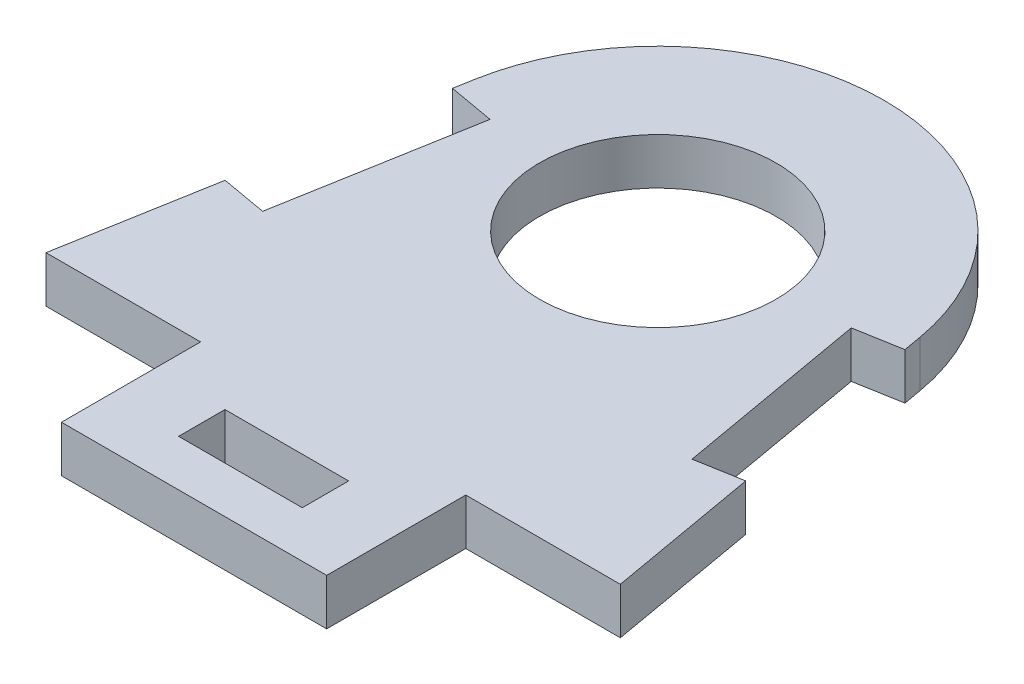
ISO-10303-21;
HEADER;
FILE_DESCRIPTION(('STEP AP214'),'2;1');
FILE_NAME('part.step','',(''),(''),'','','');
FILE_SCHEMA(('AUTOMOTIVE_DESIGN { 1 0 10303 214 1 1 1 1 }'));
ENDSEC;
DATA;
#1=APPLICATION_CONTEXT('core data for automotive mechanical design processes');
#2=APPLICATION_PROTOCOL_DEFINITION('international standard','automotive_design',2000,#1);
#3=PRODUCT_CONTEXT('',#1,'mechanical');
#4=PRODUCT('Part','Part','',(#3));
#5=PRODUCT_RELATED_PRODUCT_CATEGORY('part','',(#4));
#6=PRODUCT_DEFINITION_FORMATION('','',#4);
#7=PRODUCT_DEFINITION_CONTEXT('part definition',#1,'design');
#8=PRODUCT_DEFINITION('design','',#6,#7);
#9=PRODUCT_DEFINITION_SHAPE('','',#8);
#10=(LENGTH_UNIT() NAMED_UNIT(*) SI_UNIT(.MILLI.,.METRE.));
#11=(NAMED_UNIT(*) PLANE_ANGLE_UNIT() SI_UNIT($,.RADIAN.));
#12=(NAMED_UNIT(*) SI_UNIT($,.STERADIAN.) SOLID_ANGLE_UNIT());
#13=UNCERTAINTY_MEASURE_WITH_UNIT(LENGTH_MEASURE(1.E-05),#10,'distance_accuracy_value','');
#14=(GEOMETRIC_REPRESENTATION_CONTEXT(3) GLOBAL_UNCERTAINTY_ASSIGNED_CONTEXT((#13)) GLOBAL_UNIT_ASSIGNED_CONTEXT((#10,
#11,#12)) REPRESENTATION_CONTEXT('',''));
#15=CARTESIAN_POINT('',(0.,0.,0.));
#16=DIRECTION('',(0.,0.,1.));
#17=DIRECTION('',(1.,0.,0.));
#18=AXIS2_PLACEMENT_3D('',#15,#16,#17);
#19=CARTESIAN_POINT('',(4.,1.5,0.));
#20=DIRECTION('',(-1.,0.,0.));
#21=DIRECTION('',(0.,0.,1.));
#22=AXIS2_PLACEMENT_3D('',#19,#20,#21);
#23=PLANE('',#22);
#24=DIRECTION('',(0.,0.,-1.));
#25=VECTOR('',#24,1.);
#26=CARTESIAN_POINT('',(4.,-1.5,0.));
#27=LINE('',#26,#25);
#28=CARTESIAN_POINT('',(4.,-1.5,6.));
#29=VERTEX_POINT('',#28);
#30=CARTESIAN_POINT('',(4.,-1.5,3.));
#31=VERTEX_POINT('',#30);
#32=EDGE_CURVE('E254',#29,#31,#27,.T.);
#33=ORIENTED_EDGE('',*,*,#32,.F.);
#34=DIRECTION('',(0.,-1.,0.));
#35=VECTOR('',#34,1.);
#36=CARTESIAN_POINT('',(4.,1.5,6.));
#37=LINE('',#36,#35);
#38=CARTESIAN_POINT('',(4.,1.5,6.));
#39=VERTEX_POINT('',#38);
#40=EDGE_CURVE('E11',#39,#29,#37,.T.);
#41=ORIENTED_EDGE('',*,*,#40,.F.);
#42=DIRECTION('',(0.,0.,-1.));
#43=VECTOR('',#42,1.);
#44=CARTESIAN_POINT('',(4.,1.5,0.));
#45=LINE('',#44,#43);
#46=CARTESIAN_POINT('',(4.,1.5,3.));
#47=VERTEX_POINT('',#46);
#48=EDGE_CURVE('E207',#39,#47,#45,.T.);
#49=ORIENTED_EDGE('',*,*,#48,.T.);
#50=DIRECTION('',(0.,-1.,0.));
#51=VECTOR('',#50,1.);
#52=CARTESIAN_POINT('',(4.,1.5,3.));
#53=LINE('',#52,#51);
#54=EDGE_CURVE('E133',#47,#31,#53,.T.);
#55=ORIENTED_EDGE('',*,*,#54,.T.);
#56=EDGE_LOOP('',(#33,#41,#49,#55));
#57=FACE_BOUND('',#56,.T.);
#58=ADVANCED_FACE('F43',(#57),#23,.T.);
#59=CARTESIAN_POINT('',(0.,1.5,6.));
#60=DIRECTION('',(0.,0.,-1.));
#61=DIRECTION('',(-1.,0.,0.));
#62=AXIS2_PLACEMENT_3D('',#59,#60,#61);
#63=PLANE('',#62);
#64=DIRECTION('',(1.,0.,0.));
#65=VECTOR('',#64,1.);
#66=CARTESIAN_POINT('',(0.,-1.5,6.));
#67=LINE('',#66,#65);
#68=CARTESIAN_POINT('',(-4.,-1.5,6.));
#69=VERTEX_POINT('',#68);
#70=EDGE_CURVE('E197',#69,#29,#67,.T.);
#71=ORIENTED_EDGE('',*,*,#70,.F.);
#72=DIRECTION('',(0.,-1.,0.));
#73=VECTOR('',#72,1.);
#74=CARTESIAN_POINT('',(-4.,1.5,6.));
#75=LINE('',#74,#73);
#76=CARTESIAN_POINT('',(-4.,1.5,6.));
#77=VERTEX_POINT('',#76);
#78=EDGE_CURVE('E53',#77,#69,#75,.T.);
#79=ORIENTED_EDGE('',*,*,#78,.F.);
#80=DIRECTION('',(1.,0.,0.));
#81=VECTOR('',#80,1.);
#82=CARTESIAN_POINT('',(0.,1.5,6.));
#83=LINE('',#82,#81);
#84=EDGE_CURVE('E195',#77,#39,#83,.T.);
#85=ORIENTED_EDGE('',*,*,#84,.T.);
#86=ORIENTED_EDGE('',*,*,#40,.T.);
#87=EDGE_LOOP('',(#71,#79,#85,#86));
#88=FACE_BOUND('',#87,.T.);
#89=ADVANCED_FACE('F193',(#88),#63,.T.);
#90=CARTESIAN_POINT('',(-4.,1.5,0.));
#91=DIRECTION('',(-1.,0.,0.));
#92=DIRECTION('',(0.,0.,1.));
#93=AXIS2_PLACEMENT_3D('',#90,#91,#92);
#94=PLANE('',#93);
#95=DIRECTION('',(0.,0.,-1.));
#96=VECTOR('',#95,1.);
#97=CARTESIAN_POINT('',(-4.,-1.5,0.));
#98=LINE('',#97,#96);
#99=CARTESIAN_POINT('',(-4.,-1.5,3.));
#100=VERTEX_POINT('',#99);
#101=EDGE_CURVE('E257',#69,#100,#98,.T.);
#102=ORIENTED_EDGE('',*,*,#101,.T.);
#103=DIRECTION('',(0.,-1.,0.));
#104=VECTOR('',#103,1.);
#105=CARTESIAN_POINT('',(-4.,1.5,3.));
#106=LINE('',#105,#104);
#107=CARTESIAN_POINT('',(-4.,1.5,3.));
#108=VERTEX_POINT('',#107);
#109=EDGE_CURVE('E200',#108,#100,#106,.T.);
#110=ORIENTED_EDGE('',*,*,#109,.F.);
#111=DIRECTION('',(0.,0.,-1.));
#112=VECTOR('',#111,1.);
#113=CARTESIAN_POINT('',(-4.,1.5,0.));
#114=LINE('',#113,#112);
#115=EDGE_CURVE('E203',#77,#108,#114,.T.);
#116=ORIENTED_EDGE('',*,*,#115,.F.);
#117=ORIENTED_EDGE('',*,*,#78,.T.);
#118=EDGE_LOOP('',(#102,#110,#116,#117));
#119=FACE_BOUND('',#118,.T.);
#120=ADVANCED_FACE('F204',(#119),#94,.F.);
#121=CARTESIAN_POINT('',(0.,1.5,-21.));
#122=DIRECTION('',(0.,-1.,0.));
#123=DIRECTION('',(0.,0.,-1.));
#124=AXIS2_PLACEMENT_3D('',#121,#122,#123);
#125=CYLINDRICAL_SURFACE('',#124,14.65);
#126=CARTESIAN_POINT('',(0.,-1.5,-21.));
#127=DIRECTION('',(0.,1.,0.));
#128=DIRECTION('',(0.,0.,1.));
#129=AXIS2_PLACEMENT_3D('',#126,#127,#128);
#130=CIRCLE('',#129,14.65);
#131=CARTESIAN_POINT('',(-14.4274335816288,-1.5,-23.5439458028206));
#132=VERTEX_POINT('',#131);
#133=CARTESIAN_POINT('',(14.4274335816288,-1.5,-23.5439458028206));
#134=VERTEX_POINT('',#133);
#135=EDGE_CURVE('E215',#132,#134,#130,.F.);
#136=ORIENTED_EDGE('',*,*,#135,.F.);
#137=DIRECTION('',(0.,-1.,0.));
#138=VECTOR('',#137,1.);
#139=CARTESIAN_POINT('',(-14.4274335816288,1.5,-23.5439458028206));
#140=LINE('',#139,#138);
#141=CARTESIAN_POINT('',(-14.4274335816288,1.5,-23.5439458028206));
#142=VERTEX_POINT('',#141);
#143=EDGE_CURVE('E47',#142,#132,#140,.T.);
#144=ORIENTED_EDGE('',*,*,#143,.F.);
#145=CARTESIAN_POINT('',(0.,1.5,-21.));
#146=DIRECTION('',(0.,1.,0.));
#147=DIRECTION('',(0.,0.,1.));
#148=AXIS2_PLACEMENT_3D('',#145,#146,#147);
#149=CIRCLE('',#148,14.65);
#150=CARTESIAN_POINT('',(14.4274335816288,1.5,-23.5439458028206));
#151=VERTEX_POINT('',#150);
#152=EDGE_CURVE('E260',#142,#151,#149,.F.);
#153=ORIENTED_EDGE('',*,*,#152,.T.);
#154=DIRECTION('',(0.,-1.,0.));
#155=VECTOR('',#154,1.);
#156=CARTESIAN_POINT('',(14.4274335816288,1.5,-23.5439458028206));
#157=LINE('',#156,#155);
#158=EDGE_CURVE('E214',#151,#134,#157,.T.);
#159=ORIENTED_EDGE('',*,*,#158,.T.);
#160=EDGE_LOOP('',(#136,#144,#153,#159));
#161=FACE_BOUND('',#160,.T.);
#162=ADVANCED_FACE('F45',(#161),#125,.T.);
#163=CARTESIAN_POINT('',(-18.0186450865484,1.5,-3.17717328456859));
#164=DIRECTION('',(-0.984807753012207,0.,-0.173648177666935));
#165=DIRECTION('',(-0.173648177666935,0.,0.984807753012207));
#166=AXIS2_PLACEMENT_3D('',#163,#164,#165);
#167=PLANE('',#166);
#168=DIRECTION('',(0.173648177666935,0.,-0.984807753012207));
#169=VECTOR('',#168,1.);
#170=CARTESIAN_POINT('',(-18.0186450865484,-1.5,-3.17717328456859));
#171=LINE('',#170,#169);
#172=CARTESIAN_POINT('',(-14.6370528259646,-1.5,-22.3551359933771));
#173=VERTEX_POINT('',#172);
#174=EDGE_CURVE('E218',#173,#132,#171,.T.);
#175=ORIENTED_EDGE('',*,*,#174,.F.);
#176=DIRECTION('',(0.,-1.,0.));
#177=VECTOR('',#176,1.);
#178=CARTESIAN_POINT('',(-14.6370528259646,1.5,-22.3551359933771));
#179=LINE('',#178,#177);
#180=CARTESIAN_POINT('',(-14.6370528259646,1.5,-22.3551359933771));
#181=VERTEX_POINT('',#180);
#182=EDGE_CURVE('E296',#181,#173,#179,.T.);
#183=ORIENTED_EDGE('',*,*,#182,.F.);
#184=DIRECTION('',(0.173648177666935,0.,-0.984807753012207));
#185=VECTOR('',#184,1.);
#186=CARTESIAN_POINT('',(-18.0186450865484,1.5,-3.17717328456859));
#187=LINE('',#186,#185);
#188=EDGE_CURVE('E305',#181,#142,#187,.T.);
#189=ORIENTED_EDGE('',*,*,#188,.T.);
#190=ORIENTED_EDGE('',*,*,#143,.T.);
#191=EDGE_LOOP('',(#175,#183,#189,#190));
#192=FACE_BOUND('',#191,.T.);
#193=ADVANCED_FACE('F303',(#192),#167,.T.);
#194=CARTESIAN_POINT('',(3.3815922605838,1.5,-19.1779627088086));
#195=DIRECTION('',(0.173648177666933,0.,-0.984807753012208));
#196=DIRECTION('',(-0.984807753012208,0.,-0.173648177666933));
#197=AXIS2_PLACEMENT_3D('',#194,#195,#196);
#198=PLANE('',#197);
#199=DIRECTION('',(0.984807753012208,0.,0.173648177666933));
#200=VECTOR('',#199,1.);
#201=CARTESIAN_POINT('',(3.3815922605838,-1.5,-19.1779627088086));
#202=LINE('',#201,#200);
#203=CARTESIAN_POINT('',(-11.682629566928,-1.5,-21.8341914603763));
#204=VERTEX_POINT('',#203);
#205=EDGE_CURVE('E221',#173,#204,#202,.T.);
#206=ORIENTED_EDGE('',*,*,#205,.T.);
#207=DIRECTION('',(0.,-1.,0.));
#208=VECTOR('',#207,1.);
#209=CARTESIAN_POINT('',(-11.682629566928,1.5,-21.8341914603763));
#210=LINE('',#209,#208);
#211=CARTESIAN_POINT('',(-11.682629566928,1.5,-21.8341914603763));
#212=VERTEX_POINT('',#211);
#213=EDGE_CURVE('E294',#212,#204,#210,.T.);
#214=ORIENTED_EDGE('',*,*,#213,.F.);
#215=DIRECTION('',(0.984807753012208,0.,0.173648177666933));
#216=VECTOR('',#215,1.);
#217=CARTESIAN_POINT('',(3.3815922605838,1.5,-19.1779627088086));
#218=LINE('',#217,#216);
#219=EDGE_CURVE('E324',#181,#212,#218,.T.);
#220=ORIENTED_EDGE('',*,*,#219,.F.);
#221=ORIENTED_EDGE('',*,*,#182,.T.);
#222=EDGE_LOOP('',(#206,#214,#220,#221));
#223=FACE_BOUND('',#222,.T.);
#224=ADVANCED_FACE('F314',(#223),#198,.F.);
#225=CARTESIAN_POINT('',(-15.0642218275118,1.5,-2.65622875156779));
#226=DIRECTION('',(0.984807753012207,0.,0.173648177666935));
#227=DIRECTION('',(0.173648177666935,0.,-0.984807753012207));
#228=AXIS2_PLACEMENT_3D('',#225,#226,#227);
#229=PLANE('',#228);
#230=DIRECTION('',(-0.173648177666935,0.,0.984807753012207));
#231=VECTOR('',#230,1.);
#232=CARTESIAN_POINT('',(-15.0642218275118,-1.5,-2.65622875156779));
#233=LINE('',#232,#231);
#234=CARTESIAN_POINT('',(-13.8879614232981,-1.5,-9.32713299712127));
#235=VERTEX_POINT('',#234);
#236=EDGE_CURVE('E224',#204,#235,#233,.T.);
#237=ORIENTED_EDGE('',*,*,#236,.T.);
#238=DIRECTION('',(0.,-1.,0.));
#239=VECTOR('',#238,1.);
#240=CARTESIAN_POINT('',(-13.8879614232981,1.5,-9.32713299712127));
#241=LINE('',#240,#239);
#242=CARTESIAN_POINT('',(-13.8879614232981,1.5,-9.32713299712127));
#243=VERTEX_POINT('',#242);
#244=EDGE_CURVE('E292',#243,#235,#241,.T.);
#245=ORIENTED_EDGE('',*,*,#244,.F.);
#246=DIRECTION('',(-0.173648177666935,0.,0.984807753012207));
#247=VECTOR('',#246,1.);
#248=CARTESIAN_POINT('',(-15.0642218275118,1.5,-2.65622875156779));
#249=LINE('',#248,#247);
#250=EDGE_CURVE('E319',#212,#243,#249,.T.);
#251=ORIENTED_EDGE('',*,*,#250,.F.);
#252=ORIENTED_EDGE('',*,*,#213,.T.);
#253=EDGE_LOOP('',(#237,#245,#251,#252));
#254=FACE_BOUND('',#253,.T.);
#255=ADVANCED_FACE('F317',(#254),#229,.F.);
#256=CARTESIAN_POINT('',(1.17626040421376,1.5,-6.67090424555347));
#257=DIRECTION('',(0.173648177666935,0.,-0.984807753012207));
#258=DIRECTION('',(-0.984807753012207,0.,-0.173648177666935));
#259=AXIS2_PLACEMENT_3D('',#256,#257,#258);
#260=PLANE('',#259);
#261=DIRECTION('',(0.984807753012207,0.,0.173648177666935));
#262=VECTOR('',#261,1.);
#263=CARTESIAN_POINT('',(1.17626040421376,-1.5,-6.67090424555347));
#264=LINE('',#263,#262);
#265=CARTESIAN_POINT('',(-16.8423846823347,-1.5,-9.84807753012208));
#266=VERTEX_POINT('',#265);
#267=EDGE_CURVE('E227',#266,#235,#264,.T.);
#268=ORIENTED_EDGE('',*,*,#267,.F.);
#269=DIRECTION('',(0.,-1.,0.));
#270=VECTOR('',#269,1.);
#271=CARTESIAN_POINT('',(-16.8423846823347,1.5,-9.84807753012208));
#272=LINE('',#271,#270);
#273=CARTESIAN_POINT('',(-16.8423846823347,1.5,-9.84807753012208));
#274=VERTEX_POINT('',#273);
#275=EDGE_CURVE('E290',#274,#266,#272,.T.);
#276=ORIENTED_EDGE('',*,*,#275,.F.);
#277=DIRECTION('',(0.984807753012207,0.,0.173648177666935));
#278=VECTOR('',#277,1.);
#279=CARTESIAN_POINT('',(1.17626040421376,1.5,-6.67090424555347));
#280=LINE('',#279,#278);
#281=EDGE_CURVE('E323',#274,#243,#280,.T.);
#282=ORIENTED_EDGE('',*,*,#281,.T.);
#283=ORIENTED_EDGE('',*,*,#244,.T.);
#284=EDGE_LOOP('',(#268,#276,#282,#283));
#285=FACE_BOUND('',#284,.T.);
#286=ADVANCED_FACE('F369',(#285),#260,.T.);
#287=CARTESIAN_POINT('',(-18.578866459004,-1.5,0.));
#288=VERTEX_POINT('',#287);
#289=EDGE_CURVE('E222',#288,#266,#171,.T.);
#290=ORIENTED_EDGE('',*,*,#289,.F.);
#291=DIRECTION('',(0.,-1.,0.));
#292=VECTOR('',#291,1.);
#293=CARTESIAN_POINT('',(-18.578866459004,1.5,0.));
#294=LINE('',#293,#292);
#295=CARTESIAN_POINT('',(-18.578866459004,1.5,0.));
#296=VERTEX_POINT('',#295);
#297=EDGE_CURVE('E288',#296,#288,#294,.T.);
#298=ORIENTED_EDGE('',*,*,#297,.F.);
#299=EDGE_CURVE('E326',#296,#274,#187,.T.);
#300=ORIENTED_EDGE('',*,*,#299,.T.);
#301=ORIENTED_EDGE('',*,*,#275,.T.);
#302=EDGE_LOOP('',(#290,#298,#300,#301));
#303=FACE_BOUND('',#302,.T.);
#304=ADVANCED_FACE('F364',(#303),#167,.T.);
#305=CARTESIAN_POINT('',(0.,1.5,0.));
#306=DIRECTION('',(0.,0.,-1.));
#307=DIRECTION('',(-1.,0.,0.));
#308=AXIS2_PLACEMENT_3D('',#305,#306,#307);
#309=PLANE('',#308);
#310=DIRECTION('',(1.,0.,0.));
#311=VECTOR('',#310,1.);
#312=CARTESIAN_POINT('',(0.,-1.5,0.));
#313=LINE('',#312,#311);
#314=CARTESIAN_POINT('',(-8.57886645900403,-1.5,0.));
#315=VERTEX_POINT('',#314);
#316=EDGE_CURVE('E230',#288,#315,#313,.T.);
#317=ORIENTED_EDGE('',*,*,#316,.T.);
#318=DIRECTION('',(0.,-1.,0.));
#319=VECTOR('',#318,1.);
#320=CARTESIAN_POINT('',(-8.57886645900403,1.5,0.));
#321=LINE('',#320,#319);
#322=CARTESIAN_POINT('',(-8.57886645900403,1.5,0.));
#323=VERTEX_POINT('',#322);
#324=EDGE_CURVE('E285',#323,#315,#321,.T.);
#325=ORIENTED_EDGE('',*,*,#324,.F.);
#326=DIRECTION('',(1.,0.,0.));
#327=VECTOR('',#326,1.);
#328=CARTESIAN_POINT('',(0.,1.5,0.));
#329=LINE('',#328,#327);
#330=EDGE_CURVE('E331',#296,#323,#329,.T.);
#331=ORIENTED_EDGE('',*,*,#330,.F.);
#332=ORIENTED_EDGE('',*,*,#297,.T.);
#333=EDGE_LOOP('',(#317,#325,#331,#332));
#334=FACE_BOUND('',#333,.T.);
#335=ADVANCED_FACE('F375',(#334),#309,.F.);
#336=CARTESIAN_POINT('',(-8.57886645900403,1.5,0.));
#337=DIRECTION('',(1.,0.,0.));
#338=DIRECTION('',(0.,0.,-1.));
#339=AXIS2_PLACEMENT_3D('',#336,#337,#338);
#340=PLANE('',#339);
#341=DIRECTION('',(0.,0.,1.));
#342=VECTOR('',#341,1.);
#343=CARTESIAN_POINT('',(-8.57886645900403,-1.5,0.));
#344=LINE('',#343,#342);
#345=CARTESIAN_POINT('',(-8.57886645900403,-1.5,9.));
#346=VERTEX_POINT('',#345);
#347=EDGE_CURVE('E232',#315,#346,#344,.T.);
#348=ORIENTED_EDGE('',*,*,#347,.T.);
#349=DIRECTION('',(0.,-1.,0.));
#350=VECTOR('',#349,1.);
#351=CARTESIAN_POINT('',(-8.57886645900403,1.5,9.));
#352=LINE('',#351,#350);
#353=CARTESIAN_POINT('',(-8.57886645900403,1.5,9.));
#354=VERTEX_POINT('',#353);
#355=EDGE_CURVE('E282',#354,#346,#352,.T.);
#356=ORIENTED_EDGE('',*,*,#355,.F.);
#357=DIRECTION('',(0.,0.,1.));
#358=VECTOR('',#357,1.);
#359=CARTESIAN_POINT('',(-8.57886645900403,1.5,0.));
#360=LINE('',#359,#358);
#361=EDGE_CURVE('E333',#323,#354,#360,.T.);
#362=ORIENTED_EDGE('',*,*,#361,.F.);
#363=ORIENTED_EDGE('',*,*,#324,.T.);
#364=EDGE_LOOP('',(#348,#356,#362,#363));
#365=FACE_BOUND('',#364,.T.);
#366=ADVANCED_FACE('F378',(#365),#340,.F.);
#367=CARTESIAN_POINT('',(0.,1.5,9.));
#368=DIRECTION('',(0.,0.,-1.));
#369=DIRECTION('',(-1.,0.,0.));
#370=AXIS2_PLACEMENT_3D('',#367,#368,#369);
#371=PLANE('',#370);
#372=DIRECTION('',(1.,0.,0.));
#373=VECTOR('',#372,1.);
#374=CARTESIAN_POINT('',(0.,-1.5,9.));
#375=LINE('',#374,#373);
#376=CARTESIAN_POINT('',(8.57886645900403,-1.5,9.));
#377=VERTEX_POINT('',#376);
#378=EDGE_CURVE('E235',#346,#377,#375,.T.);
#379=ORIENTED_EDGE('',*,*,#378,.T.);
#380=DIRECTION('',(0.,-1.,0.));
#381=VECTOR('',#380,1.);
#382=CARTESIAN_POINT('',(8.57886645900403,1.5,9.));
#383=LINE('',#382,#381);
#384=CARTESIAN_POINT('',(8.57886645900403,1.5,9.));
#385=VERTEX_POINT('',#384);
#386=EDGE_CURVE('E279',#385,#377,#383,.T.);
#387=ORIENTED_EDGE('',*,*,#386,.F.);
#388=DIRECTION('',(1.,0.,0.));
#389=VECTOR('',#388,1.);
#390=CARTESIAN_POINT('',(0.,1.5,9.));
#391=LINE('',#390,#389);
#392=EDGE_CURVE('E336',#354,#385,#391,.T.);
#393=ORIENTED_EDGE('',*,*,#392,.F.);
#394=ORIENTED_EDGE('',*,*,#355,.T.);
#395=EDGE_LOOP('',(#379,#387,#393,#394));
#396=FACE_BOUND('',#395,.T.);
#397=ADVANCED_FACE('F385',(#396),#371,.F.);
#398=CARTESIAN_POINT('',(8.57886645900403,1.5,0.));
#399=DIRECTION('',(-1.,0.,0.));
#400=DIRECTION('',(0.,0.,1.));
#401=AXIS2_PLACEMENT_3D('',#398,#399,#400);
#402=PLANE('',#401);
#403=DIRECTION('',(0.,0.,-1.));
#404=VECTOR('',#403,1.);
#405=CARTESIAN_POINT('',(8.57886645900403,-1.5,0.));
#406=LINE('',#405,#404);
#407=CARTESIAN_POINT('',(8.57886645900403,-1.5,0.));
#408=VERTEX_POINT('',#407);
#409=EDGE_CURVE('E237',#377,#408,#406,.T.);
#410=ORIENTED_EDGE('',*,*,#409,.T.);
#411=DIRECTION('',(0.,-1.,0.));
#412=VECTOR('',#411,1.);
#413=CARTESIAN_POINT('',(8.57886645900403,1.5,0.));
#414=LINE('',#413,#412);
#415=CARTESIAN_POINT('',(8.57886645900403,1.5,0.));
#416=VERTEX_POINT('',#415);
#417=EDGE_CURVE('E276',#416,#408,#414,.T.);
#418=ORIENTED_EDGE('',*,*,#417,.F.);
#419=DIRECTION('',(0.,0.,-1.));
#420=VECTOR('',#419,1.);
#421=CARTESIAN_POINT('',(8.57886645900403,1.5,0.));
#422=LINE('',#421,#420);
#423=EDGE_CURVE('E338',#385,#416,#422,.T.);
#424=ORIENTED_EDGE('',*,*,#423,.F.);
#425=ORIENTED_EDGE('',*,*,#386,.T.);
#426=EDGE_LOOP('',(#410,#418,#424,#425));
#427=FACE_BOUND('',#426,.T.);
#428=ADVANCED_FACE('F388',(#427),#402,.F.);
#429=CARTESIAN_POINT('',(18.578866459004,-1.5,0.));
#430=VERTEX_POINT('',#429);
#431=EDGE_CURVE('E233',#408,#430,#313,.T.);
#432=ORIENTED_EDGE('',*,*,#431,.T.);
#433=DIRECTION('',(0.,-1.,0.));
#434=VECTOR('',#433,1.);
#435=CARTESIAN_POINT('',(18.578866459004,1.5,0.));
#436=LINE('',#435,#434);
#437=CARTESIAN_POINT('',(18.578866459004,1.5,0.));
#438=VERTEX_POINT('',#437);
#439=EDGE_CURVE('E273',#438,#430,#436,.T.);
#440=ORIENTED_EDGE('',*,*,#439,.F.);
#441=EDGE_CURVE('E334',#416,#438,#329,.T.);
#442=ORIENTED_EDGE('',*,*,#441,.F.);
#443=ORIENTED_EDGE('',*,*,#417,.T.);
#444=EDGE_LOOP('',(#432,#440,#442,#443));
#445=FACE_BOUND('',#444,.T.);
#446=ADVANCED_FACE('F393',(#445),#309,.F.);
#447=CARTESIAN_POINT('',(18.0186450865484,1.5,-3.17717328456859));
#448=DIRECTION('',(-0.984807753012207,0.,0.173648177666935));
#449=DIRECTION('',(0.173648177666935,0.,0.984807753012207));
#450=AXIS2_PLACEMENT_3D('',#447,#448,#449);
#451=PLANE('',#450);
#452=DIRECTION('',(-0.173648177666935,0.,-0.984807753012207));
#453=VECTOR('',#452,1.);
#454=CARTESIAN_POINT('',(18.0186450865484,-1.5,-3.17717328456859));
#455=LINE('',#454,#453);
#456=CARTESIAN_POINT('',(16.8423846823347,-1.5,-9.84807753012207));
#457=VERTEX_POINT('',#456);
#458=EDGE_CURVE('E239',#430,#457,#455,.T.);
#459=ORIENTED_EDGE('',*,*,#458,.T.);
#460=DIRECTION('',(0.,-1.,0.));
#461=VECTOR('',#460,1.);
#462=CARTESIAN_POINT('',(16.8423846823347,1.5,-9.84807753012207));
#463=LINE('',#462,#461);
#464=CARTESIAN_POINT('',(16.8423846823347,1.5,-9.84807753012207));
#465=VERTEX_POINT('',#464);
#466=EDGE_CURVE('E270',#465,#457,#463,.T.);
#467=ORIENTED_EDGE('',*,*,#466,.F.);
#468=DIRECTION('',(-0.173648177666935,0.,-0.984807753012207));
#469=VECTOR('',#468,1.);
#470=CARTESIAN_POINT('',(18.0186450865484,1.5,-3.17717328456859));
#471=LINE('',#470,#469);
#472=EDGE_CURVE('E340',#438,#465,#471,.T.);
#473=ORIENTED_EDGE('',*,*,#472,.F.);
#474=ORIENTED_EDGE('',*,*,#439,.T.);
#475=EDGE_LOOP('',(#459,#467,#473,#474));
#476=FACE_BOUND('',#475,.T.);
#477=ADVANCED_FACE('F399',(#476),#451,.F.);
#478=CARTESIAN_POINT('',(-1.17626040421376,1.5,-6.67090424555349));
#479=DIRECTION('',(0.173648177666934,0.,0.984807753012207));
#480=DIRECTION('',(0.984807753012207,0.,-0.173648177666935));
#481=AXIS2_PLACEMENT_3D('',#478,#479,#480);
#482=PLANE('',#481);
#483=DIRECTION('',(-0.984807753012207,0.,0.173648177666935));
#484=VECTOR('',#483,1.);
#485=CARTESIAN_POINT('',(-1.17626040421376,-1.5,-6.67090424555349));
#486=LINE('',#485,#484);
#487=CARTESIAN_POINT('',(13.8879614232981,-1.5,-9.32713299712127));
#488=VERTEX_POINT('',#487);
#489=EDGE_CURVE('E241',#457,#488,#486,.T.);
#490=ORIENTED_EDGE('',*,*,#489,.T.);
#491=DIRECTION('',(0.,-1.,0.));
#492=VECTOR('',#491,1.);
#493=CARTESIAN_POINT('',(13.8879614232981,1.5,-9.32713299712127));
#494=LINE('',#493,#492);
#495=CARTESIAN_POINT('',(13.8879614232981,1.5,-9.32713299712127));
#496=VERTEX_POINT('',#495);
#497=EDGE_CURVE('E268',#496,#488,#494,.T.);
#498=ORIENTED_EDGE('',*,*,#497,.F.);
#499=DIRECTION('',(-0.984807753012207,0.,0.173648177666935));
#500=VECTOR('',#499,1.);
#501=CARTESIAN_POINT('',(-1.17626040421376,1.5,-6.67090424555349));
#502=LINE('',#501,#500);
#503=EDGE_CURVE('E342',#465,#496,#502,.T.);
#504=ORIENTED_EDGE('',*,*,#503,.F.);
#505=ORIENTED_EDGE('',*,*,#466,.T.);
#506=EDGE_LOOP('',(#490,#498,#504,#505));
#507=FACE_BOUND('',#506,.T.);
#508=ADVANCED_FACE('F403',(#507),#482,.F.);
#509=CARTESIAN_POINT('',(15.0642218275118,1.5,-2.65622875156778));
#510=DIRECTION('',(0.984807753012207,0.,-0.173648177666934));
#511=DIRECTION('',(-0.173648177666935,0.,-0.984807753012207));
#512=AXIS2_PLACEMENT_3D('',#509,#510,#511);
#513=PLANE('',#512);
#514=DIRECTION('',(0.173648177666935,0.,0.984807753012207));
#515=VECTOR('',#514,1.);
#516=CARTESIAN_POINT('',(15.0642218275118,-1.5,-2.65622875156778));
#517=LINE('',#516,#515);
#518=CARTESIAN_POINT('',(11.682629566928,-1.5,-21.8341914603763));
#519=VERTEX_POINT('',#518);
#520=EDGE_CURVE('E245',#519,#488,#517,.T.);
#521=ORIENTED_EDGE('',*,*,#520,.F.);
#522=DIRECTION('',(0.,-1.,0.));
#523=VECTOR('',#522,1.);
#524=CARTESIAN_POINT('',(11.682629566928,1.5,-21.8341914603763));
#525=LINE('',#524,#523);
#526=CARTESIAN_POINT('',(11.682629566928,1.5,-21.8341914603763));
#527=VERTEX_POINT('',#526);
#528=EDGE_CURVE('E266',#527,#519,#525,.T.);
#529=ORIENTED_EDGE('',*,*,#528,.F.);
#530=DIRECTION('',(0.173648177666935,0.,0.984807753012207));
#531=VECTOR('',#530,1.);
#532=CARTESIAN_POINT('',(15.0642218275118,1.5,-2.65622875156778));
#533=LINE('',#532,#531);
#534=EDGE_CURVE('E345',#527,#496,#533,.T.);
#535=ORIENTED_EDGE('',*,*,#534,.T.);
#536=ORIENTED_EDGE('',*,*,#497,.T.);
#537=EDGE_LOOP('',(#521,#529,#535,#536));
#538=FACE_BOUND('',#537,.T.);
#539=ADVANCED_FACE('F406',(#538),#513,.T.);
#540=CARTESIAN_POINT('',(-3.38159226058383,1.5,-19.1779627088085));
#541=DIRECTION('',(0.173648177666935,0.,0.984807753012207));
#542=DIRECTION('',(0.984807753012207,0.,-0.173648177666935));
#543=AXIS2_PLACEMENT_3D('',#540,#541,#542);
#544=PLANE('',#543);
#545=DIRECTION('',(-0.984807753012207,0.,0.173648177666935));
#546=VECTOR('',#545,1.);
#547=CARTESIAN_POINT('',(-3.38159226058383,-1.5,-19.1779627088085));
#548=LINE('',#547,#546);
#549=CARTESIAN_POINT('',(14.6370528259646,-1.5,-22.3551359933771));
#550=VERTEX_POINT('',#549);
#551=EDGE_CURVE('E248',#550,#519,#548,.T.);
#552=ORIENTED_EDGE('',*,*,#551,.F.);
#553=DIRECTION('',(0.,-1.,0.));
#554=VECTOR('',#553,1.);
#555=CARTESIAN_POINT('',(14.6370528259646,1.5,-22.3551359933771));
#556=LINE('',#555,#554);
#557=CARTESIAN_POINT('',(14.6370528259646,1.5,-22.3551359933771));
#558=VERTEX_POINT('',#557);
#559=EDGE_CURVE('E264',#558,#550,#556,.T.);
#560=ORIENTED_EDGE('',*,*,#559,.F.);
#561=DIRECTION('',(-0.984807753012207,0.,0.173648177666935));
#562=VECTOR('',#561,1.);
#563=CARTESIAN_POINT('',(-3.38159226058383,1.5,-19.1779627088085));
#564=LINE('',#563,#562);
#565=EDGE_CURVE('E348',#558,#527,#564,.T.);
#566=ORIENTED_EDGE('',*,*,#565,.T.);
#567=ORIENTED_EDGE('',*,*,#528,.T.);
#568=EDGE_LOOP('',(#552,#560,#566,#567));
#569=FACE_BOUND('',#568,.T.);
#570=ADVANCED_FACE('F409',(#569),#544,.T.);
#571=CARTESIAN_POINT('',(0.,1.5,-21.));
#572=DIRECTION('',(0.,-1.,0.));
#573=DIRECTION('',(0.,0.,-1.));
#574=AXIS2_PLACEMENT_3D('',#571,#572,#573);
#575=CYLINDRICAL_SURFACE('',#574,7.65);
#576=CARTESIAN_POINT('',(0.,1.5,-21.));
#577=DIRECTION('',(0.,1.,0.));
#578=DIRECTION('',(0.,0.,1.));
#579=AXIS2_PLACEMENT_3D('',#576,#577,#578);
#580=CIRCLE('',#579,7.65);
#581=CARTESIAN_POINT('',(0.,1.5,-13.35));
#582=VERTEX_POINT('',#581);
#583=EDGE_CURVE('E209',#582,#582,#580,.T.);
#584=ORIENTED_EDGE('',*,*,#583,.T.);
#585=EDGE_LOOP('',(#584));
#586=FACE_BOUND('',#585,.T.);
#587=CARTESIAN_POINT('',(0.,-1.5,-21.));
#588=DIRECTION('',(0.,1.,0.));
#589=DIRECTION('',(0.,0.,1.));
#590=AXIS2_PLACEMENT_3D('',#587,#588,#589);
#591=CIRCLE('',#590,7.65);
#592=CARTESIAN_POINT('',(0.,-1.5,-13.35));
#593=VERTEX_POINT('',#592);
#594=EDGE_CURVE('E251',#593,#593,#591,.T.);
#595=ORIENTED_EDGE('',*,*,#594,.F.);
#596=EDGE_LOOP('',(#595));
#597=FACE_BOUND('',#596,.T.);
#598=ADVANCED_FACE('F411',(#586,#597),#575,.F.);
#599=EDGE_CURVE('E242',#550,#134,#455,.T.);
#600=ORIENTED_EDGE('',*,*,#599,.T.);
#601=ORIENTED_EDGE('',*,*,#158,.F.);
#602=EDGE_CURVE('E343',#558,#151,#471,.T.);
#603=ORIENTED_EDGE('',*,*,#602,.F.);
#604=ORIENTED_EDGE('',*,*,#559,.T.);
#605=EDGE_LOOP('',(#600,#601,#603,#604));
#606=FACE_BOUND('',#605,.T.);
#607=ADVANCED_FACE('F358',(#606),#451,.F.);
#608=CARTESIAN_POINT('',(0.,1.5,3.));
#609=DIRECTION('',(0.,0.,-1.));
#610=DIRECTION('',(-1.,0.,0.));
#611=AXIS2_PLACEMENT_3D('',#608,#609,#610);
#612=PLANE('',#611);
#613=DIRECTION('',(1.,0.,0.));
#614=VECTOR('',#613,1.);
#615=CARTESIAN_POINT('',(0.,-1.5,3.));
#616=LINE('',#615,#614);
#617=EDGE_CURVE('E126',#100,#31,#616,.T.);
#618=ORIENTED_EDGE('',*,*,#617,.T.);
#619=ORIENTED_EDGE('',*,*,#54,.F.);
#620=DIRECTION('',(1.,0.,0.));
#621=VECTOR('',#620,1.);
#622=CARTESIAN_POINT('',(0.,1.5,3.));
#623=LINE('',#622,#621);
#624=EDGE_CURVE('E62',#108,#47,#623,.T.);
#625=ORIENTED_EDGE('',*,*,#624,.F.);
#626=ORIENTED_EDGE('',*,*,#109,.T.);
#627=EDGE_LOOP('',(#618,#619,#625,#626));
#628=FACE_BOUND('',#627,.T.);
#629=ADVANCED_FACE('F428',(#628),#612,.F.);
#630=CARTESIAN_POINT('',(0.,1.5,0.));
#631=DIRECTION('',(0.,1.,0.));
#632=DIRECTION('',(0.,0.,1.));
#633=AXIS2_PLACEMENT_3D('',#630,#631,#632);
#634=PLANE('',#633);
#635=ORIENTED_EDGE('',*,*,#152,.F.);
#636=ORIENTED_EDGE('',*,*,#188,.F.);
#637=ORIENTED_EDGE('',*,*,#219,.T.);
#638=ORIENTED_EDGE('',*,*,#250,.T.);
#639=ORIENTED_EDGE('',*,*,#281,.F.);
#640=ORIENTED_EDGE('',*,*,#299,.F.);
#641=ORIENTED_EDGE('',*,*,#330,.T.);
#642=ORIENTED_EDGE('',*,*,#361,.T.);
#643=ORIENTED_EDGE('',*,*,#392,.T.);
#644=ORIENTED_EDGE('',*,*,#423,.T.);
#645=ORIENTED_EDGE('',*,*,#441,.T.);
#646=ORIENTED_EDGE('',*,*,#472,.T.);
#647=ORIENTED_EDGE('',*,*,#503,.T.);
#648=ORIENTED_EDGE('',*,*,#534,.F.);
#649=ORIENTED_EDGE('',*,*,#565,.F.);
#650=ORIENTED_EDGE('',*,*,#602,.T.);
#651=EDGE_LOOP('',(#635,#636,#637,#638,#639,#640,#641,#642,#643,#644,#645,#646,#647,#648,#649,#650));
#652=FACE_BOUND('',#651,.T.);
#653=ORIENTED_EDGE('',*,*,#583,.F.);
#654=EDGE_LOOP('',(#653));
#655=FACE_BOUND('',#654,.T.);
#656=ORIENTED_EDGE('',*,*,#48,.F.);
#657=ORIENTED_EDGE('',*,*,#84,.F.);
#658=ORIENTED_EDGE('',*,*,#115,.T.);
#659=ORIENTED_EDGE('',*,*,#624,.T.);
#660=EDGE_LOOP('',(#656,#657,#658,#659));
#661=FACE_BOUND('',#660,.T.);
#662=ADVANCED_FACE('F206',(#652,#655,#661),#634,.T.);
#663=CARTESIAN_POINT('',(0.,-1.5,0.));
#664=DIRECTION('',(0.,1.,0.));
#665=DIRECTION('',(0.,0.,1.));
#666=AXIS2_PLACEMENT_3D('',#663,#664,#665);
#667=PLANE('',#666);
#668=ORIENTED_EDGE('',*,*,#135,.T.);
#669=ORIENTED_EDGE('',*,*,#599,.F.);
#670=ORIENTED_EDGE('',*,*,#551,.T.);
#671=ORIENTED_EDGE('',*,*,#520,.T.);
#672=ORIENTED_EDGE('',*,*,#489,.F.);
#673=ORIENTED_EDGE('',*,*,#458,.F.);
#674=ORIENTED_EDGE('',*,*,#431,.F.);
#675=ORIENTED_EDGE('',*,*,#409,.F.);
#676=ORIENTED_EDGE('',*,*,#378,.F.);
#677=ORIENTED_EDGE('',*,*,#347,.F.);
#678=ORIENTED_EDGE('',*,*,#316,.F.);
#679=ORIENTED_EDGE('',*,*,#289,.T.);
#680=ORIENTED_EDGE('',*,*,#267,.T.);
#681=ORIENTED_EDGE('',*,*,#236,.F.);
#682=ORIENTED_EDGE('',*,*,#205,.F.);
#683=ORIENTED_EDGE('',*,*,#174,.T.);
#684=EDGE_LOOP('',(#668,#669,#670,#671,#672,#673,#674,#675,#676,#677,#678,#679,#680,#681,#682,#683));
#685=FACE_BOUND('',#684,.T.);
#686=ORIENTED_EDGE('',*,*,#594,.T.);
#687=EDGE_LOOP('',(#686));
#688=FACE_BOUND('',#687,.T.);
#689=ORIENTED_EDGE('',*,*,#32,.T.);
#690=ORIENTED_EDGE('',*,*,#617,.F.);
#691=ORIENTED_EDGE('',*,*,#101,.F.);
#692=ORIENTED_EDGE('',*,*,#70,.T.);
#693=EDGE_LOOP('',(#689,#690,#691,#692));
#694=FACE_BOUND('',#693,.T.);
#695=ADVANCED_FACE('F310',(#685,#688,#694),#667,.F.);
#696=CLOSED_SHELL('',(#58,#89,#120,#162,#193,#224,#255,#286,#304,#335,#366,#397,#428,#446,#477,
#508,#539,#570,#598,#607,#629,#662,#695));
#697=MANIFOLD_SOLID_BREP('B2',#696);
#698=ADVANCED_BREP_SHAPE_REPRESENTATION('',(#18,#697),#14);
#699=SHAPE_DEFINITION_REPRESENTATION(#9,#698);
ENDSEC;
END-ISO-10303-21;
